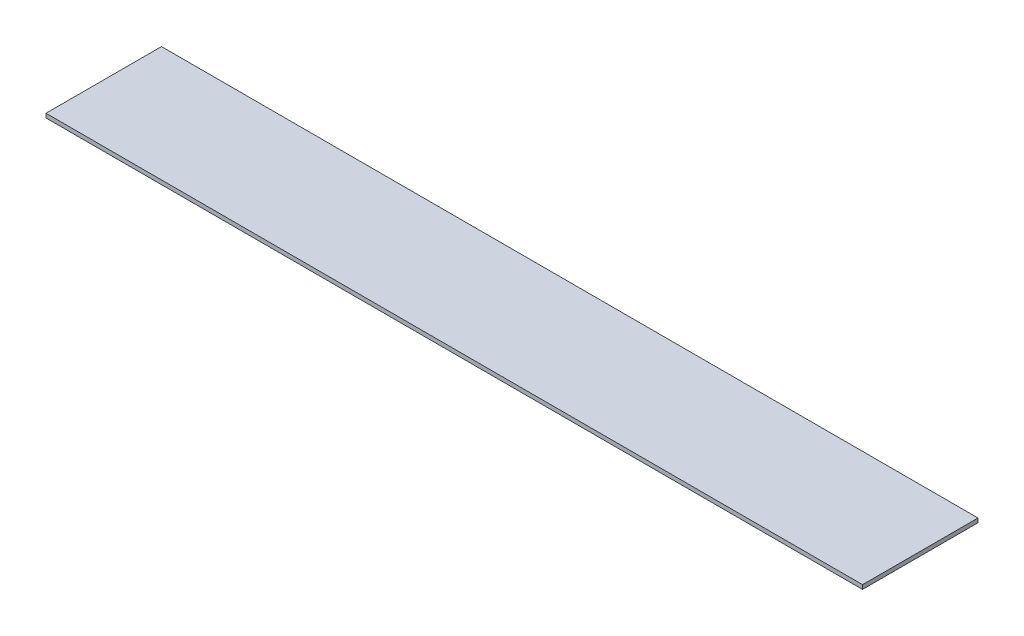
ISO-10303-21;
HEADER;
FILE_DESCRIPTION(('STEP AP214'),'2;1');
FILE_NAME('part.step','',(''),(''),'','','');
FILE_SCHEMA(('AUTOMOTIVE_DESIGN { 1 0 10303 214 1 1 1 1 }'));
ENDSEC;
DATA;
#1=APPLICATION_CONTEXT('core data for automotive mechanical design processes');
#2=APPLICATION_PROTOCOL_DEFINITION('international standard','automotive_design',2000,#1);
#3=PRODUCT_CONTEXT('',#1,'mechanical');
#4=PRODUCT('Part','Part','',(#3));
#5=PRODUCT_RELATED_PRODUCT_CATEGORY('part','',(#4));
#6=PRODUCT_DEFINITION_FORMATION('','',#4);
#7=PRODUCT_DEFINITION_CONTEXT('part definition',#1,'design');
#8=PRODUCT_DEFINITION('design','',#6,#7);
#9=PRODUCT_DEFINITION_SHAPE('','',#8);
#10=(LENGTH_UNIT() NAMED_UNIT(*) SI_UNIT(.MILLI.,.METRE.));
#11=(NAMED_UNIT(*) PLANE_ANGLE_UNIT() SI_UNIT($,.RADIAN.));
#12=(NAMED_UNIT(*) SI_UNIT($,.STERADIAN.) SOLID_ANGLE_UNIT());
#13=UNCERTAINTY_MEASURE_WITH_UNIT(LENGTH_MEASURE(1.E-05),#10,'distance_accuracy_value','');
#14=(GEOMETRIC_REPRESENTATION_CONTEXT(3) GLOBAL_UNCERTAINTY_ASSIGNED_CONTEXT((#13)) GLOBAL_UNIT_ASSIGNED_CONTEXT((#10,
#11,#12)) REPRESENTATION_CONTEXT('',''));
#15=CARTESIAN_POINT('',(0.,0.,0.));
#16=DIRECTION('',(0.,0.,1.));
#17=DIRECTION('',(1.,0.,0.));
#18=AXIS2_PLACEMENT_3D('',#15,#16,#17);
#19=CARTESIAN_POINT('',(1209.75080176923,1827.86710603682,1121.25455636952));
#20=DIRECTION('',(-1.,0.,0.));
#21=DIRECTION('',(0.,0.,1.));
#22=AXIS2_PLACEMENT_3D('',#19,#20,#21);
#23=PLANE('',#22);
#24=DIRECTION('',(0.,0.,-1.));
#25=VECTOR('',#24,1.);
#26=CARTESIAN_POINT('',(1209.75080176923,1821.51710603682,1121.25455636952));
#27=LINE('',#26,#25);
#28=CARTESIAN_POINT('',(1209.75080176923,1821.51710603682,1121.25455636952));
#29=VERTEX_POINT('',#28);
#30=CARTESIAN_POINT('',(1209.75080176923,1821.51710603682,943.454556369519));
#31=VERTEX_POINT('',#30);
#32=EDGE_CURVE('E96',#29,#31,#27,.T.);
#33=ORIENTED_EDGE('',*,*,#32,.T.);
#34=DIRECTION('',(0.,-1.,0.));
#35=VECTOR('',#34,1.);
#36=CARTESIAN_POINT('',(1209.75080176923,1827.86710603682,943.454556369519));
#37=LINE('',#36,#35);
#38=CARTESIAN_POINT('',(1209.75080176923,1827.86710603682,943.454556369519));
#39=VERTEX_POINT('',#38);
#40=EDGE_CURVE('E11',#39,#31,#37,.T.);
#41=ORIENTED_EDGE('',*,*,#40,.F.);
#42=DIRECTION('',(0.,0.,-1.));
#43=VECTOR('',#42,1.);
#44=CARTESIAN_POINT('',(1209.75080176923,1827.86710603682,1121.25455636952));
#45=LINE('',#44,#43);
#46=CARTESIAN_POINT('',(1209.75080176923,1827.86710603682,1121.25455636952));
#47=VERTEX_POINT('',#46);
#48=EDGE_CURVE('E84',#47,#39,#45,.T.);
#49=ORIENTED_EDGE('',*,*,#48,.F.);
#50=DIRECTION('',(0.,-1.,0.));
#51=VECTOR('',#50,1.);
#52=CARTESIAN_POINT('',(1209.75080176923,1827.86710603682,1121.25455636952));
#53=LINE('',#52,#51);
#54=EDGE_CURVE('E92',#47,#29,#53,.T.);
#55=ORIENTED_EDGE('',*,*,#54,.T.);
#56=EDGE_LOOP('',(#33,#41,#49,#55));
#57=FACE_BOUND('',#56,.T.);
#58=ADVANCED_FACE('F33',(#57),#23,.F.);
#59=CARTESIAN_POINT('',(1209.75080176923,1827.86710603682,943.454556369519));
#60=DIRECTION('',(0.,0.,1.));
#61=DIRECTION('',(1.,0.,0.));
#62=AXIS2_PLACEMENT_3D('',#59,#60,#61);
#63=PLANE('',#62);
#64=DIRECTION('',(-1.,0.,0.));
#65=VECTOR('',#64,1.);
#66=CARTESIAN_POINT('',(1209.75080176923,1821.51710603682,943.454556369519));
#67=LINE('',#66,#65);
#68=CARTESIAN_POINT('',(-47.5491982307663,1821.51710603682,943.454556369519));
#69=VERTEX_POINT('',#68);
#70=EDGE_CURVE('E88',#31,#69,#67,.T.);
#71=ORIENTED_EDGE('',*,*,#70,.T.);
#72=DIRECTION('',(0.,-1.,0.));
#73=VECTOR('',#72,1.);
#74=CARTESIAN_POINT('',(-47.5491982307663,1827.86710603682,943.454556369519));
#75=LINE('',#74,#73);
#76=CARTESIAN_POINT('',(-47.5491982307663,1827.86710603682,943.454556369519));
#77=VERTEX_POINT('',#76);
#78=EDGE_CURVE('E41',#77,#69,#75,.T.);
#79=ORIENTED_EDGE('',*,*,#78,.F.);
#80=DIRECTION('',(-1.,0.,0.));
#81=VECTOR('',#80,1.);
#82=CARTESIAN_POINT('',(1209.75080176923,1827.86710603682,943.454556369519));
#83=LINE('',#82,#81);
#84=EDGE_CURVE('E79',#39,#77,#83,.T.);
#85=ORIENTED_EDGE('',*,*,#84,.F.);
#86=ORIENTED_EDGE('',*,*,#40,.T.);
#87=EDGE_LOOP('',(#71,#79,#85,#86));
#88=FACE_BOUND('',#87,.T.);
#89=ADVANCED_FACE('F87',(#88),#63,.F.);
#90=CARTESIAN_POINT('',(-47.5491982307663,1827.86710603682,1121.25455636952));
#91=DIRECTION('',(1.,0.,0.));
#92=DIRECTION('',(0.,0.,-1.));
#93=AXIS2_PLACEMENT_3D('',#90,#91,#92);
#94=PLANE('',#93);
#95=DIRECTION('',(0.,0.,1.));
#96=VECTOR('',#95,1.);
#97=CARTESIAN_POINT('',(-47.5491982307663,1821.51710603682,1121.25455636952));
#98=LINE('',#97,#96);
#99=CARTESIAN_POINT('',(-47.5491982307663,1821.51710603682,1121.25455636952));
#100=VERTEX_POINT('',#99);
#101=EDGE_CURVE('E66',#69,#100,#98,.T.);
#102=ORIENTED_EDGE('',*,*,#101,.T.);
#103=DIRECTION('',(0.,-1.,0.));
#104=VECTOR('',#103,1.);
#105=CARTESIAN_POINT('',(-47.5491982307663,1827.86710603682,1121.25455636952));
#106=LINE('',#105,#104);
#107=CARTESIAN_POINT('',(-47.5491982307663,1827.86710603682,1121.25455636952));
#108=VERTEX_POINT('',#107);
#109=EDGE_CURVE('E89',#108,#100,#106,.T.);
#110=ORIENTED_EDGE('',*,*,#109,.F.);
#111=DIRECTION('',(0.,0.,1.));
#112=VECTOR('',#111,1.);
#113=CARTESIAN_POINT('',(-47.5491982307663,1827.86710603682,1121.25455636952));
#114=LINE('',#113,#112);
#115=EDGE_CURVE('E82',#77,#108,#114,.T.);
#116=ORIENTED_EDGE('',*,*,#115,.F.);
#117=ORIENTED_EDGE('',*,*,#78,.T.);
#118=EDGE_LOOP('',(#102,#110,#116,#117));
#119=FACE_BOUND('',#118,.T.);
#120=ADVANCED_FACE('F90',(#119),#94,.F.);
#121=CARTESIAN_POINT('',(1209.75080176923,1827.86710603682,1121.25455636952));
#122=DIRECTION('',(0.,0.,-1.));
#123=DIRECTION('',(-1.,0.,0.));
#124=AXIS2_PLACEMENT_3D('',#121,#122,#123);
#125=PLANE('',#124);
#126=DIRECTION('',(1.,0.,0.));
#127=VECTOR('',#126,1.);
#128=CARTESIAN_POINT('',(1209.75080176923,1821.51710603682,1121.25455636952));
#129=LINE('',#128,#127);
#130=EDGE_CURVE('E72',#100,#29,#129,.T.);
#131=ORIENTED_EDGE('',*,*,#130,.T.);
#132=ORIENTED_EDGE('',*,*,#54,.F.);
#133=DIRECTION('',(1.,0.,0.));
#134=VECTOR('',#133,1.);
#135=CARTESIAN_POINT('',(1209.75080176923,1827.86710603682,1121.25455636952));
#136=LINE('',#135,#134);
#137=EDGE_CURVE('E49',#108,#47,#136,.T.);
#138=ORIENTED_EDGE('',*,*,#137,.F.);
#139=ORIENTED_EDGE('',*,*,#109,.T.);
#140=EDGE_LOOP('',(#131,#132,#138,#139));
#141=FACE_BOUND('',#140,.T.);
#142=ADVANCED_FACE('F103',(#141),#125,.F.);
#143=CARTESIAN_POINT('',(0.,1827.86710603682,0.));
#144=DIRECTION('',(0.,1.,0.));
#145=DIRECTION('',(0.,0.,1.));
#146=AXIS2_PLACEMENT_3D('',#143,#144,#145);
#147=PLANE('',#146);
#148=ORIENTED_EDGE('',*,*,#48,.T.);
#149=ORIENTED_EDGE('',*,*,#84,.T.);
#150=ORIENTED_EDGE('',*,*,#115,.T.);
#151=ORIENTED_EDGE('',*,*,#137,.T.);
#152=EDGE_LOOP('',(#148,#149,#150,#151));
#153=FACE_BOUND('',#152,.T.);
#154=ADVANCED_FACE('F80',(#153),#147,.T.);
#155=CARTESIAN_POINT('',(0.,1821.51710603682,0.));
#156=DIRECTION('',(0.,1.,0.));
#157=DIRECTION('',(0.,0.,1.));
#158=AXIS2_PLACEMENT_3D('',#155,#156,#157);
#159=PLANE('',#158);
#160=ORIENTED_EDGE('',*,*,#32,.F.);
#161=ORIENTED_EDGE('',*,*,#130,.F.);
#162=ORIENTED_EDGE('',*,*,#101,.F.);
#163=ORIENTED_EDGE('',*,*,#70,.F.);
#164=EDGE_LOOP('',(#160,#161,#162,#163));
#165=FACE_BOUND('',#164,.T.);
#166=ADVANCED_FACE('F106',(#165),#159,.F.);
#167=CLOSED_SHELL('',(#58,#89,#120,#142,#154,#166));
#168=MANIFOLD_SOLID_BREP('B2',#167);
#169=ADVANCED_BREP_SHAPE_REPRESENTATION('',(#18,#168),#14);
#170=SHAPE_DEFINITION_REPRESENTATION(#9,#169);
ENDSEC;
END-ISO-10303-21;
